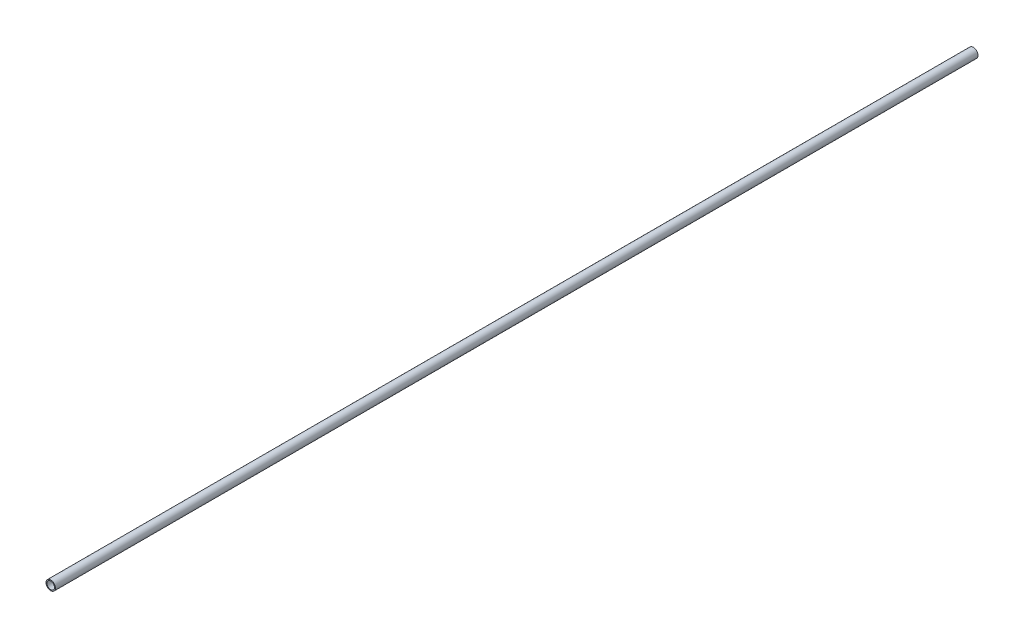
ISO-10303-21;
HEADER;
FILE_DESCRIPTION(('STEP AP214'),'2;1');
FILE_NAME('part.step','',(''),(''),'','','');
FILE_SCHEMA(('AUTOMOTIVE_DESIGN { 1 0 10303 214 1 1 1 1 }'));
ENDSEC;
DATA;
#1=APPLICATION_CONTEXT('core data for automotive mechanical design processes');
#2=APPLICATION_PROTOCOL_DEFINITION('international standard','automotive_design',2000,#1);
#3=PRODUCT_CONTEXT('',#1,'mechanical');
#4=PRODUCT('Part','Part','',(#3));
#5=PRODUCT_RELATED_PRODUCT_CATEGORY('part','',(#4));
#6=PRODUCT_DEFINITION_FORMATION('','',#4);
#7=PRODUCT_DEFINITION_CONTEXT('part definition',#1,'design');
#8=PRODUCT_DEFINITION('design','',#6,#7);
#9=PRODUCT_DEFINITION_SHAPE('','',#8);
#10=(LENGTH_UNIT() NAMED_UNIT(*) SI_UNIT(.MILLI.,.METRE.));
#11=(NAMED_UNIT(*) PLANE_ANGLE_UNIT() SI_UNIT($,.RADIAN.));
#12=(NAMED_UNIT(*) SI_UNIT($,.STERADIAN.) SOLID_ANGLE_UNIT());
#13=UNCERTAINTY_MEASURE_WITH_UNIT(LENGTH_MEASURE(1.E-05),#10,'distance_accuracy_value','');
#14=(GEOMETRIC_REPRESENTATION_CONTEXT(3) GLOBAL_UNCERTAINTY_ASSIGNED_CONTEXT((#13)) GLOBAL_UNIT_ASSIGNED_CONTEXT((#10,
#11,#12)) REPRESENTATION_CONTEXT('',''));
#15=CARTESIAN_POINT('',(0.,0.,0.));
#16=DIRECTION('',(0.,0.,1.));
#17=DIRECTION('',(1.,0.,0.));
#18=AXIS2_PLACEMENT_3D('',#15,#16,#17);
#19=CARTESIAN_POINT('',(0.,0.,1244.6));
#20=DIRECTION('',(0.,0.,1.));
#21=DIRECTION('',(1.,0.,0.));
#22=AXIS2_PLACEMENT_3D('',#19,#20,#21);
#23=PLANE('',#22);
#24=CARTESIAN_POINT('',(0.,0.,1244.6));
#25=DIRECTION('',(0.,0.,1.));
#26=DIRECTION('',(1.,0.,0.));
#27=AXIS2_PLACEMENT_3D('',#24,#25,#26);
#28=CIRCLE('',#27,6.35);
#29=CARTESIAN_POINT('',(6.35,0.,1244.6));
#30=VERTEX_POINT('',#29);
#31=EDGE_CURVE('E10',#30,#30,#28,.T.);
#32=ORIENTED_EDGE('',*,*,#31,.T.);
#33=EDGE_LOOP('',(#32));
#34=FACE_BOUND('',#33,.T.);
#35=CARTESIAN_POINT('',(0.,0.,1244.6));
#36=DIRECTION('',(0.,0.,1.));
#37=DIRECTION('',(1.,0.,0.));
#38=AXIS2_PLACEMENT_3D('',#35,#36,#37);
#39=CIRCLE('',#38,5.08);
#40=CARTESIAN_POINT('',(5.08,0.,1244.6));
#41=VERTEX_POINT('',#40);
#42=EDGE_CURVE('E44',#41,#41,#39,.T.);
#43=ORIENTED_EDGE('',*,*,#42,.F.);
#44=EDGE_LOOP('',(#43));
#45=FACE_BOUND('',#44,.T.);
#46=ADVANCED_FACE('F33',(#34,#45),#23,.T.);
#47=CARTESIAN_POINT('',(0.,0.,0.));
#48=DIRECTION('',(0.,0.,1.));
#49=DIRECTION('',(1.,0.,0.));
#50=AXIS2_PLACEMENT_3D('',#47,#48,#49);
#51=PLANE('',#50);
#52=CARTESIAN_POINT('',(0.,0.,0.));
#53=DIRECTION('',(0.,0.,1.));
#54=DIRECTION('',(1.,0.,0.));
#55=AXIS2_PLACEMENT_3D('',#52,#53,#54);
#56=CIRCLE('',#55,6.35);
#57=CARTESIAN_POINT('',(6.35,0.,0.));
#58=VERTEX_POINT('',#57);
#59=EDGE_CURVE('E37',#58,#58,#56,.T.);
#60=ORIENTED_EDGE('',*,*,#59,.F.);
#61=EDGE_LOOP('',(#60));
#62=FACE_BOUND('',#61,.T.);
#63=CARTESIAN_POINT('',(0.,0.,0.));
#64=DIRECTION('',(0.,0.,1.));
#65=DIRECTION('',(1.,0.,0.));
#66=AXIS2_PLACEMENT_3D('',#63,#64,#65);
#67=CIRCLE('',#66,5.08);
#68=CARTESIAN_POINT('',(5.08,0.,0.));
#69=VERTEX_POINT('',#68);
#70=EDGE_CURVE('E46',#69,#69,#67,.T.);
#71=ORIENTED_EDGE('',*,*,#70,.T.);
#72=EDGE_LOOP('',(#71));
#73=FACE_BOUND('',#72,.T.);
#74=ADVANCED_FACE('F56',(#62,#73),#51,.F.);
#75=CARTESIAN_POINT('',(0.,0.,1244.6));
#76=DIRECTION('',(0.,0.,-1.));
#77=DIRECTION('',(-1.,0.,0.));
#78=AXIS2_PLACEMENT_3D('',#75,#76,#77);
#79=CYLINDRICAL_SURFACE('',#78,6.35);
#80=ORIENTED_EDGE('',*,*,#31,.F.);
#81=EDGE_LOOP('',(#80));
#82=FACE_BOUND('',#81,.T.);
#83=ORIENTED_EDGE('',*,*,#59,.T.);
#84=EDGE_LOOP('',(#83));
#85=FACE_BOUND('',#84,.T.);
#86=ADVANCED_FACE('F35',(#82,#85),#79,.T.);
#87=CARTESIAN_POINT('',(0.,0.,1244.6));
#88=DIRECTION('',(0.,0.,-1.));
#89=DIRECTION('',(-1.,0.,0.));
#90=AXIS2_PLACEMENT_3D('',#87,#88,#89);
#91=CYLINDRICAL_SURFACE('',#90,5.08);
#92=ORIENTED_EDGE('',*,*,#42,.T.);
#93=EDGE_LOOP('',(#92));
#94=FACE_BOUND('',#93,.T.);
#95=ORIENTED_EDGE('',*,*,#70,.F.);
#96=EDGE_LOOP('',(#95));
#97=FACE_BOUND('',#96,.T.);
#98=ADVANCED_FACE('F52',(#94,#97),#91,.F.);
#99=CLOSED_SHELL('',(#46,#74,#86,#98));
#100=MANIFOLD_SOLID_BREP('B2',#99);
#101=ADVANCED_BREP_SHAPE_REPRESENTATION('',(#18,#100),#14);
#102=SHAPE_DEFINITION_REPRESENTATION(#9,#101);
ENDSEC;
END-ISO-10303-21;
